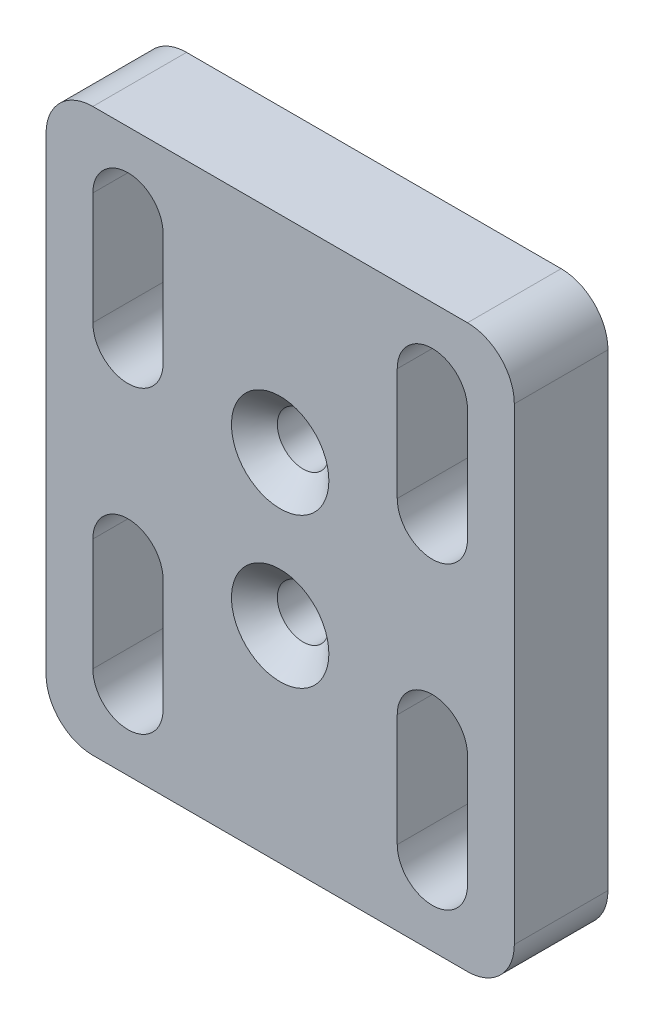
ISO-10303-21;
HEADER;
FILE_DESCRIPTION(('STEP AP214'),'2;1');
FILE_NAME('part.step','',(''),(''),'','','');
FILE_SCHEMA(('AUTOMOTIVE_DESIGN { 1 0 10303 214 1 1 1 1 }'));
ENDSEC;
DATA;
#1=APPLICATION_CONTEXT('core data for automotive mechanical design processes');
#2=APPLICATION_PROTOCOL_DEFINITION('international standard','automotive_design',2000,#1);
#3=PRODUCT_CONTEXT('',#1,'mechanical');
#4=PRODUCT('Part','Part','',(#3));
#5=PRODUCT_RELATED_PRODUCT_CATEGORY('part','',(#4));
#6=PRODUCT_DEFINITION_FORMATION('','',#4);
#7=PRODUCT_DEFINITION_CONTEXT('part definition',#1,'design');
#8=PRODUCT_DEFINITION('design','',#6,#7);
#9=PRODUCT_DEFINITION_SHAPE('','',#8);
#10=(LENGTH_UNIT() NAMED_UNIT(*) SI_UNIT(.MILLI.,.METRE.));
#11=(NAMED_UNIT(*) PLANE_ANGLE_UNIT() SI_UNIT($,.RADIAN.));
#12=(NAMED_UNIT(*) SI_UNIT($,.STERADIAN.) SOLID_ANGLE_UNIT());
#13=UNCERTAINTY_MEASURE_WITH_UNIT(LENGTH_MEASURE(1.E-05),#10,'distance_accuracy_value','');
#14=(GEOMETRIC_REPRESENTATION_CONTEXT(3) GLOBAL_UNCERTAINTY_ASSIGNED_CONTEXT((#13)) GLOBAL_UNIT_ASSIGNED_CONTEXT((#10,
#11,#12)) REPRESENTATION_CONTEXT('',''));
#15=CARTESIAN_POINT('',(0.,0.,0.));
#16=DIRECTION('',(0.,0.,1.));
#17=DIRECTION('',(1.,0.,0.));
#18=AXIS2_PLACEMENT_3D('',#15,#16,#17);
#19=CARTESIAN_POINT('',(0.,0.,10.));
#20=DIRECTION('',(1.,0.,0.));
#21=DIRECTION('',(0.,0.,-1.));
#22=AXIS2_PLACEMENT_3D('',#19,#20,#21);
#23=PLANE('',#22);
#24=DIRECTION('',(0.,-1.,0.));
#25=VECTOR('',#24,1.);
#26=CARTESIAN_POINT('',(0.,0.,0.));
#27=LINE('',#26,#25);
#28=CARTESIAN_POINT('',(0.,55.,0.));
#29=VERTEX_POINT('',#28);
#30=CARTESIAN_POINT('',(0.,5.,0.));
#31=VERTEX_POINT('',#30);
#32=EDGE_CURVE('E330',#29,#31,#27,.T.);
#33=ORIENTED_EDGE('',*,*,#32,.T.);
#34=DIRECTION('',(0.,0.,-1.));
#35=VECTOR('',#34,1.);
#36=CARTESIAN_POINT('',(0.,5.,10.));
#37=LINE('',#36,#35);
#38=CARTESIAN_POINT('',(0.,5.,10.));
#39=VERTEX_POINT('',#38);
#40=EDGE_CURVE('E389',#31,#39,#37,.F.);
#41=ORIENTED_EDGE('',*,*,#40,.T.);
#42=DIRECTION('',(0.,-1.,0.));
#43=VECTOR('',#42,1.);
#44=CARTESIAN_POINT('',(0.,0.,10.));
#45=LINE('',#44,#43);
#46=CARTESIAN_POINT('',(0.,55.,10.));
#47=VERTEX_POINT('',#46);
#48=EDGE_CURVE('E337',#47,#39,#45,.T.);
#49=ORIENTED_EDGE('',*,*,#48,.F.);
#50=DIRECTION('',(0.,0.,-1.));
#51=VECTOR('',#50,1.);
#52=CARTESIAN_POINT('',(0.,55.,10.));
#53=LINE('',#52,#51);
#54=EDGE_CURVE('E386',#47,#29,#53,.T.);
#55=ORIENTED_EDGE('',*,*,#54,.T.);
#56=EDGE_LOOP('',(#33,#41,#49,#55));
#57=FACE_BOUND('',#56,.T.);
#58=ADVANCED_FACE('F37',(#57),#23,.F.);
#59=CARTESIAN_POINT('',(0.,0.,10.));
#60=DIRECTION('',(0.,1.,0.));
#61=DIRECTION('',(0.,0.,1.));
#62=AXIS2_PLACEMENT_3D('',#59,#60,#61);
#63=PLANE('',#62);
#64=DIRECTION('',(1.,0.,0.));
#65=VECTOR('',#64,1.);
#66=CARTESIAN_POINT('',(0.,0.,0.));
#67=LINE('',#66,#65);
#68=CARTESIAN_POINT('',(5.,0.,0.));
#69=VERTEX_POINT('',#68);
#70=CARTESIAN_POINT('',(45.,0.,0.));
#71=VERTEX_POINT('',#70);
#72=EDGE_CURVE('E353',#69,#71,#67,.T.);
#73=ORIENTED_EDGE('',*,*,#72,.T.);
#74=DIRECTION('',(0.,0.,-1.));
#75=VECTOR('',#74,1.);
#76=CARTESIAN_POINT('',(45.,0.,10.));
#77=LINE('',#76,#75);
#78=CARTESIAN_POINT('',(45.,0.,10.));
#79=VERTEX_POINT('',#78);
#80=EDGE_CURVE('E376',#71,#79,#77,.F.);
#81=ORIENTED_EDGE('',*,*,#80,.T.);
#82=DIRECTION('',(1.,0.,0.));
#83=VECTOR('',#82,1.);
#84=CARTESIAN_POINT('',(0.,0.,10.));
#85=LINE('',#84,#83);
#86=CARTESIAN_POINT('',(5.,0.,10.));
#87=VERTEX_POINT('',#86);
#88=EDGE_CURVE('E340',#87,#79,#85,.T.);
#89=ORIENTED_EDGE('',*,*,#88,.F.);
#90=DIRECTION('',(0.,0.,-1.));
#91=VECTOR('',#90,1.);
#92=CARTESIAN_POINT('',(5.,0.,10.));
#93=LINE('',#92,#91);
#94=EDGE_CURVE('E373',#87,#69,#93,.T.);
#95=ORIENTED_EDGE('',*,*,#94,.T.);
#96=EDGE_LOOP('',(#73,#81,#89,#95));
#97=FACE_BOUND('',#96,.T.);
#98=ADVANCED_FACE('F465',(#97),#63,.F.);
#99=CARTESIAN_POINT('',(50.,0.,10.));
#100=DIRECTION('',(-1.,0.,0.));
#101=DIRECTION('',(0.,0.,1.));
#102=AXIS2_PLACEMENT_3D('',#99,#100,#101);
#103=PLANE('',#102);
#104=DIRECTION('',(0.,1.,0.));
#105=VECTOR('',#104,1.);
#106=CARTESIAN_POINT('',(50.,0.,10.));
#107=LINE('',#106,#105);
#108=CARTESIAN_POINT('',(50.,5.,10.));
#109=VERTEX_POINT('',#108);
#110=CARTESIAN_POINT('',(50.,55.,10.));
#111=VERTEX_POINT('',#110);
#112=EDGE_CURVE('E344',#109,#111,#107,.T.);
#113=ORIENTED_EDGE('',*,*,#112,.F.);
#114=DIRECTION('',(0.,0.,-1.));
#115=VECTOR('',#114,1.);
#116=CARTESIAN_POINT('',(50.,5.,10.));
#117=LINE('',#116,#115);
#118=CARTESIAN_POINT('',(50.,5.,0.));
#119=VERTEX_POINT('',#118);
#120=EDGE_CURVE('E362',#109,#119,#117,.T.);
#121=ORIENTED_EDGE('',*,*,#120,.T.);
#122=DIRECTION('',(0.,1.,0.));
#123=VECTOR('',#122,1.);
#124=CARTESIAN_POINT('',(50.,0.,0.));
#125=LINE('',#124,#123);
#126=CARTESIAN_POINT('',(50.,55.,0.));
#127=VERTEX_POINT('',#126);
#128=EDGE_CURVE('E356',#119,#127,#125,.T.);
#129=ORIENTED_EDGE('',*,*,#128,.T.);
#130=DIRECTION('',(0.,0.,-1.));
#131=VECTOR('',#130,1.);
#132=CARTESIAN_POINT('',(50.,55.,10.));
#133=LINE('',#132,#131);
#134=EDGE_CURVE('E350',#127,#111,#133,.F.);
#135=ORIENTED_EDGE('',*,*,#134,.T.);
#136=EDGE_LOOP('',(#113,#121,#129,#135));
#137=FACE_BOUND('',#136,.T.);
#138=ADVANCED_FACE('F444',(#137),#103,.F.);
#139=CARTESIAN_POINT('',(0.,60.,10.));
#140=DIRECTION('',(0.,-1.,0.));
#141=DIRECTION('',(0.,0.,-1.));
#142=AXIS2_PLACEMENT_3D('',#139,#140,#141);
#143=PLANE('',#142);
#144=DIRECTION('',(-1.,0.,0.));
#145=VECTOR('',#144,1.);
#146=CARTESIAN_POINT('',(0.,60.,0.));
#147=LINE('',#146,#145);
#148=CARTESIAN_POINT('',(45.,60.,0.));
#149=VERTEX_POINT('',#148);
#150=CARTESIAN_POINT('',(5.,60.,0.));
#151=VERTEX_POINT('',#150);
#152=EDGE_CURVE('E341',#149,#151,#147,.T.);
#153=ORIENTED_EDGE('',*,*,#152,.T.);
#154=DIRECTION('',(0.,0.,-1.));
#155=VECTOR('',#154,1.);
#156=CARTESIAN_POINT('',(5.,60.,10.));
#157=LINE('',#156,#155);
#158=CARTESIAN_POINT('',(5.,60.,10.));
#159=VERTEX_POINT('',#158);
#160=EDGE_CURVE('E11',#151,#159,#157,.F.);
#161=ORIENTED_EDGE('',*,*,#160,.T.);
#162=DIRECTION('',(-1.,0.,0.));
#163=VECTOR('',#162,1.);
#164=CARTESIAN_POINT('',(0.,60.,10.));
#165=LINE('',#164,#163);
#166=CARTESIAN_POINT('',(45.,60.,10.));
#167=VERTEX_POINT('',#166);
#168=EDGE_CURVE('E347',#167,#159,#165,.T.);
#169=ORIENTED_EDGE('',*,*,#168,.F.);
#170=DIRECTION('',(0.,0.,-1.));
#171=VECTOR('',#170,1.);
#172=CARTESIAN_POINT('',(45.,60.,10.));
#173=LINE('',#172,#171);
#174=EDGE_CURVE('E46',#167,#149,#173,.T.);
#175=ORIENTED_EDGE('',*,*,#174,.T.);
#176=EDGE_LOOP('',(#153,#161,#169,#175));
#177=FACE_BOUND('',#176,.T.);
#178=ADVANCED_FACE('F416',(#177),#143,.F.);
#179=CARTESIAN_POINT('',(0.,0.,10.));
#180=DIRECTION('',(0.,0.,-1.));
#181=DIRECTION('',(-1.,0.,0.));
#182=AXIS2_PLACEMENT_3D('',#179,#180,#181);
#183=PLANE('',#182);
#184=CARTESIAN_POINT('',(25.,38.,10.));
#185=DIRECTION('',(0.,0.,1.));
#186=DIRECTION('',(1.,0.,0.));
#187=AXIS2_PLACEMENT_3D('',#184,#185,#186);
#188=CIRCLE('',#187,5.2);
#189=CARTESIAN_POINT('',(30.2,38.,10.));
#190=VERTEX_POINT('',#189);
#191=EDGE_CURVE('E407',#190,#190,#188,.T.);
#192=ORIENTED_EDGE('',*,*,#191,.F.);
#193=EDGE_LOOP('',(#192));
#194=FACE_BOUND('',#193,.T.);
#195=CARTESIAN_POINT('',(25.,22.,10.));
#196=DIRECTION('',(0.,0.,1.));
#197=DIRECTION('',(1.,0.,0.));
#198=AXIS2_PLACEMENT_3D('',#195,#196,#197);
#199=CIRCLE('',#198,5.2);
#200=CARTESIAN_POINT('',(30.2,22.,10.));
#201=VERTEX_POINT('',#200);
#202=EDGE_CURVE('E396',#201,#201,#199,.T.);
#203=ORIENTED_EDGE('',*,*,#202,.F.);
#204=EDGE_LOOP('',(#203));
#205=FACE_BOUND('',#204,.T.);
#206=DIRECTION('',(0.,1.,0.));
#207=VECTOR('',#206,1.);
#208=CARTESIAN_POINT('',(12.5,40.,10.));
#209=LINE('',#208,#207);
#210=CARTESIAN_POINT('',(12.5,40.,10.));
#211=VERTEX_POINT('',#210);
#212=CARTESIAN_POINT('',(12.5,52.,10.));
#213=VERTEX_POINT('',#212);
#214=EDGE_CURVE('E258',#211,#213,#209,.T.);
#215=ORIENTED_EDGE('',*,*,#214,.F.);
#216=CARTESIAN_POINT('',(8.75000000000002,40.,10.));
#217=DIRECTION('',(0.,0.,1.));
#218=DIRECTION('',(-1.,0.,0.));
#219=AXIS2_PLACEMENT_3D('',#216,#217,#218);
#220=CIRCLE('',#219,3.74999999999998);
#221=CARTESIAN_POINT('',(5.00000000000001,40.,10.));
#222=VERTEX_POINT('',#221);
#223=EDGE_CURVE('E54',#222,#211,#220,.T.);
#224=ORIENTED_EDGE('',*,*,#223,.F.);
#225=DIRECTION('',(0.,-1.,0.));
#226=VECTOR('',#225,1.);
#227=CARTESIAN_POINT('',(5.00000000000001,40.,10.));
#228=LINE('',#227,#226);
#229=CARTESIAN_POINT('',(5.00000000000001,52.,10.));
#230=VERTEX_POINT('',#229);
#231=EDGE_CURVE('E247',#230,#222,#228,.T.);
#232=ORIENTED_EDGE('',*,*,#231,.F.);
#233=CARTESIAN_POINT('',(8.75000000000002,52.,10.));
#234=DIRECTION('',(0.,0.,1.));
#235=DIRECTION('',(-1.,0.,0.));
#236=AXIS2_PLACEMENT_3D('',#233,#234,#235);
#237=CIRCLE('',#236,3.75000000000001);
#238=EDGE_CURVE('E262',#213,#230,#237,.T.);
#239=ORIENTED_EDGE('',*,*,#238,.F.);
#240=EDGE_LOOP('',(#215,#224,#232,#239));
#241=FACE_BOUND('',#240,.T.);
#242=DIRECTION('',(0.,-1.,0.));
#243=VECTOR('',#242,1.);
#244=CARTESIAN_POINT('',(37.5,20.,10.));
#245=LINE('',#244,#243);
#246=CARTESIAN_POINT('',(37.5,20.,10.));
#247=VERTEX_POINT('',#246);
#248=CARTESIAN_POINT('',(37.5,8.00000000000001,10.));
#249=VERTEX_POINT('',#248);
#250=EDGE_CURVE('E232',#247,#249,#245,.T.);
#251=ORIENTED_EDGE('',*,*,#250,.F.);
#252=CARTESIAN_POINT('',(41.25,20.,10.));
#253=DIRECTION('',(0.,0.,1.));
#254=DIRECTION('',(-1.,0.,0.));
#255=AXIS2_PLACEMENT_3D('',#252,#253,#254);
#256=CIRCLE('',#255,3.75);
#257=CARTESIAN_POINT('',(45.,20.,10.));
#258=VERTEX_POINT('',#257);
#259=EDGE_CURVE('E62',#258,#247,#256,.T.);
#260=ORIENTED_EDGE('',*,*,#259,.F.);
#261=DIRECTION('',(0.,1.,0.));
#262=VECTOR('',#261,1.);
#263=CARTESIAN_POINT('',(45.,20.,10.));
#264=LINE('',#263,#262);
#265=CARTESIAN_POINT('',(45.,8.00000000000001,10.));
#266=VERTEX_POINT('',#265);
#267=EDGE_CURVE('E220',#266,#258,#264,.T.);
#268=ORIENTED_EDGE('',*,*,#267,.F.);
#269=CARTESIAN_POINT('',(41.25,8.,10.));
#270=DIRECTION('',(0.,0.,1.));
#271=DIRECTION('',(-1.,0.,0.));
#272=AXIS2_PLACEMENT_3D('',#269,#270,#271);
#273=CIRCLE('',#272,3.75);
#274=EDGE_CURVE('E223',#249,#266,#273,.T.);
#275=ORIENTED_EDGE('',*,*,#274,.F.);
#276=EDGE_LOOP('',(#251,#260,#268,#275));
#277=FACE_BOUND('',#276,.T.);
#278=DIRECTION('',(0.,1.,0.));
#279=VECTOR('',#278,1.);
#280=CARTESIAN_POINT('',(45.,40.,10.));
#281=LINE('',#280,#279);
#282=CARTESIAN_POINT('',(45.,40.,10.));
#283=VERTEX_POINT('',#282);
#284=CARTESIAN_POINT('',(45.,52.,10.));
#285=VERTEX_POINT('',#284);
#286=EDGE_CURVE('E288',#283,#285,#281,.T.);
#287=ORIENTED_EDGE('',*,*,#286,.F.);
#288=CARTESIAN_POINT('',(41.25,40.,10.));
#289=DIRECTION('',(0.,0.,1.));
#290=DIRECTION('',(1.,0.,0.));
#291=AXIS2_PLACEMENT_3D('',#288,#289,#290);
#292=CIRCLE('',#291,3.75);
#293=CARTESIAN_POINT('',(37.5,40.,10.));
#294=VERTEX_POINT('',#293);
#295=EDGE_CURVE('E239',#294,#283,#292,.T.);
#296=ORIENTED_EDGE('',*,*,#295,.F.);
#297=DIRECTION('',(0.,-1.,0.));
#298=VECTOR('',#297,1.);
#299=CARTESIAN_POINT('',(37.5,40.,10.));
#300=LINE('',#299,#298);
#301=CARTESIAN_POINT('',(37.5,52.,10.));
#302=VERTEX_POINT('',#301);
#303=EDGE_CURVE('E277',#302,#294,#300,.T.);
#304=ORIENTED_EDGE('',*,*,#303,.F.);
#305=CARTESIAN_POINT('',(41.25,52.,10.));
#306=DIRECTION('',(0.,0.,1.));
#307=DIRECTION('',(1.,0.,0.));
#308=AXIS2_PLACEMENT_3D('',#305,#306,#307);
#309=CIRCLE('',#308,3.75);
#310=EDGE_CURVE('E291',#285,#302,#309,.T.);
#311=ORIENTED_EDGE('',*,*,#310,.F.);
#312=EDGE_LOOP('',(#287,#296,#304,#311));
#313=FACE_BOUND('',#312,.T.);
#314=DIRECTION('',(0.,-1.,0.));
#315=VECTOR('',#314,1.);
#316=CARTESIAN_POINT('',(5.00000000000001,20.,10.));
#317=LINE('',#316,#315);
#318=CARTESIAN_POINT('',(5.00000000000001,20.,10.));
#319=VERTEX_POINT('',#318);
#320=CARTESIAN_POINT('',(5.00000000000001,7.99999999999999,10.));
#321=VERTEX_POINT('',#320);
#322=EDGE_CURVE('E320',#319,#321,#317,.T.);
#323=ORIENTED_EDGE('',*,*,#322,.F.);
#324=CARTESIAN_POINT('',(8.75000000000002,20.,10.));
#325=DIRECTION('',(0.,0.,1.));
#326=DIRECTION('',(1.,0.,0.));
#327=AXIS2_PLACEMENT_3D('',#324,#325,#326);
#328=CIRCLE('',#327,3.74999999999998);
#329=CARTESIAN_POINT('',(12.5,20.,10.));
#330=VERTEX_POINT('',#329);
#331=EDGE_CURVE('E298',#330,#319,#328,.T.);
#332=ORIENTED_EDGE('',*,*,#331,.F.);
#333=DIRECTION('',(0.,1.,0.));
#334=VECTOR('',#333,1.);
#335=CARTESIAN_POINT('',(12.5,20.,10.));
#336=LINE('',#335,#334);
#337=CARTESIAN_POINT('',(12.5,8.,10.));
#338=VERTEX_POINT('',#337);
#339=EDGE_CURVE('E309',#338,#330,#336,.T.);
#340=ORIENTED_EDGE('',*,*,#339,.F.);
#341=CARTESIAN_POINT('',(8.75000000000002,8.,10.));
#342=DIRECTION('',(0.,0.,1.));
#343=DIRECTION('',(1.,0.,0.));
#344=AXIS2_PLACEMENT_3D('',#341,#342,#343);
#345=CIRCLE('',#344,3.75000000000001);
#346=EDGE_CURVE('E323',#321,#338,#345,.T.);
#347=ORIENTED_EDGE('',*,*,#346,.F.);
#348=EDGE_LOOP('',(#323,#332,#340,#347));
#349=FACE_BOUND('',#348,.T.);
#350=ORIENTED_EDGE('',*,*,#88,.T.);
#351=CARTESIAN_POINT('',(45.,5.,10.));
#352=DIRECTION('',(0.,0.,-1.));
#353=DIRECTION('',(-1.,0.,0.));
#354=AXIS2_PLACEMENT_3D('',#351,#352,#353);
#355=CIRCLE('',#354,5.);
#356=EDGE_CURVE('E384',#79,#109,#355,.F.);
#357=ORIENTED_EDGE('',*,*,#356,.T.);
#358=ORIENTED_EDGE('',*,*,#112,.T.);
#359=CARTESIAN_POINT('',(45.,55.,10.));
#360=DIRECTION('',(0.,0.,-1.));
#361=DIRECTION('',(-1.,0.,0.));
#362=AXIS2_PLACEMENT_3D('',#359,#360,#361);
#363=CIRCLE('',#362,5.);
#364=EDGE_CURVE('E378',#111,#167,#363,.F.);
#365=ORIENTED_EDGE('',*,*,#364,.T.);
#366=ORIENTED_EDGE('',*,*,#168,.T.);
#367=CARTESIAN_POINT('',(5.,55.,10.));
#368=DIRECTION('',(0.,0.,-1.));
#369=DIRECTION('',(-1.,0.,0.));
#370=AXIS2_PLACEMENT_3D('',#367,#368,#369);
#371=CIRCLE('',#370,5.);
#372=EDGE_CURVE('E380',#159,#47,#371,.F.);
#373=ORIENTED_EDGE('',*,*,#372,.T.);
#374=ORIENTED_EDGE('',*,*,#48,.T.);
#375=CARTESIAN_POINT('',(5.,5.,10.));
#376=DIRECTION('',(0.,0.,-1.));
#377=DIRECTION('',(-1.,0.,0.));
#378=AXIS2_PLACEMENT_3D('',#375,#376,#377);
#379=CIRCLE('',#378,5.);
#380=EDGE_CURVE('E382',#39,#87,#379,.F.);
#381=ORIENTED_EDGE('',*,*,#380,.T.);
#382=EDGE_LOOP('',(#350,#357,#358,#365,#366,#373,#374,#381));
#383=FACE_BOUND('',#382,.T.);
#384=ADVANCED_FACE('F413',(#194,#205,#241,#277,#313,#349,#383),#183,.F.);
#385=CARTESIAN_POINT('',(0.,0.,0.));
#386=DIRECTION('',(0.,0.,-1.));
#387=DIRECTION('',(-1.,0.,0.));
#388=AXIS2_PLACEMENT_3D('',#385,#386,#387);
#389=PLANE('',#388);
#390=CARTESIAN_POINT('',(25.,38.,0.));
#391=DIRECTION('',(0.,0.,-1.));
#392=DIRECTION('',(-1.,0.,0.));
#393=AXIS2_PLACEMENT_3D('',#390,#391,#392);
#394=CIRCLE('',#393,2.74999999999999);
#395=CARTESIAN_POINT('',(22.25,38.,0.));
#396=VERTEX_POINT('',#395);
#397=EDGE_CURVE('E41',#396,#396,#394,.T.);
#398=ORIENTED_EDGE('',*,*,#397,.F.);
#399=EDGE_LOOP('',(#398));
#400=FACE_BOUND('',#399,.T.);
#401=CARTESIAN_POINT('',(25.,22.,0.));
#402=DIRECTION('',(0.,0.,-1.));
#403=DIRECTION('',(-1.,0.,0.));
#404=AXIS2_PLACEMENT_3D('',#401,#402,#403);
#405=CIRCLE('',#404,2.74999999999999);
#406=CARTESIAN_POINT('',(22.25,22.,0.));
#407=VERTEX_POINT('',#406);
#408=EDGE_CURVE('E259',#407,#407,#405,.T.);
#409=ORIENTED_EDGE('',*,*,#408,.F.);
#410=EDGE_LOOP('',(#409));
#411=FACE_BOUND('',#410,.T.);
#412=CARTESIAN_POINT('',(8.75000000000002,40.,0.));
#413=DIRECTION('',(0.,0.,1.));
#414=DIRECTION('',(-1.,0.,0.));
#415=AXIS2_PLACEMENT_3D('',#412,#413,#414);
#416=CIRCLE('',#415,3.74999999999998);
#417=CARTESIAN_POINT('',(5.00000000000001,40.,0.));
#418=VERTEX_POINT('',#417);
#419=CARTESIAN_POINT('',(12.5,40.,0.));
#420=VERTEX_POINT('',#419);
#421=EDGE_CURVE('E243',#418,#420,#416,.T.);
#422=ORIENTED_EDGE('',*,*,#421,.T.);
#423=DIRECTION('',(0.,1.,0.));
#424=VECTOR('',#423,1.);
#425=CARTESIAN_POINT('',(12.5,40.,0.));
#426=LINE('',#425,#424);
#427=CARTESIAN_POINT('',(12.5,52.,0.));
#428=VERTEX_POINT('',#427);
#429=EDGE_CURVE('E246',#420,#428,#426,.T.);
#430=ORIENTED_EDGE('',*,*,#429,.T.);
#431=CARTESIAN_POINT('',(8.75000000000002,52.,0.));
#432=DIRECTION('',(0.,0.,1.));
#433=DIRECTION('',(-1.,0.,0.));
#434=AXIS2_PLACEMENT_3D('',#431,#432,#433);
#435=CIRCLE('',#434,3.75000000000001);
#436=CARTESIAN_POINT('',(5.00000000000001,52.,0.));
#437=VERTEX_POINT('',#436);
#438=EDGE_CURVE('E250',#428,#437,#435,.T.);
#439=ORIENTED_EDGE('',*,*,#438,.T.);
#440=DIRECTION('',(0.,-1.,0.));
#441=VECTOR('',#440,1.);
#442=CARTESIAN_POINT('',(5.00000000000001,40.,0.));
#443=LINE('',#442,#441);
#444=EDGE_CURVE('E253',#437,#418,#443,.T.);
#445=ORIENTED_EDGE('',*,*,#444,.T.);
#446=EDGE_LOOP('',(#422,#430,#439,#445));
#447=FACE_BOUND('',#446,.T.);
#448=CARTESIAN_POINT('',(41.25,20.,0.));
#449=DIRECTION('',(0.,0.,1.));
#450=DIRECTION('',(-1.,0.,0.));
#451=AXIS2_PLACEMENT_3D('',#448,#449,#450);
#452=CIRCLE('',#451,3.75);
#453=CARTESIAN_POINT('',(45.,20.,0.));
#454=VERTEX_POINT('',#453);
#455=CARTESIAN_POINT('',(37.5,20.,0.));
#456=VERTEX_POINT('',#455);
#457=EDGE_CURVE('E201',#454,#456,#452,.T.);
#458=ORIENTED_EDGE('',*,*,#457,.T.);
#459=DIRECTION('',(0.,-1.,0.));
#460=VECTOR('',#459,1.);
#461=CARTESIAN_POINT('',(37.5,20.,0.));
#462=LINE('',#461,#460);
#463=CARTESIAN_POINT('',(37.5,8.00000000000001,0.));
#464=VERTEX_POINT('',#463);
#465=EDGE_CURVE('E211',#456,#464,#462,.T.);
#466=ORIENTED_EDGE('',*,*,#465,.T.);
#467=CARTESIAN_POINT('',(41.25,8.,0.));
#468=DIRECTION('',(0.,0.,1.));
#469=DIRECTION('',(-1.,0.,0.));
#470=AXIS2_PLACEMENT_3D('',#467,#468,#469);
#471=CIRCLE('',#470,3.75);
#472=CARTESIAN_POINT('',(45.,8.00000000000001,0.));
#473=VERTEX_POINT('',#472);
#474=EDGE_CURVE('E215',#464,#473,#471,.T.);
#475=ORIENTED_EDGE('',*,*,#474,.T.);
#476=DIRECTION('',(0.,1.,0.));
#477=VECTOR('',#476,1.);
#478=CARTESIAN_POINT('',(45.,20.,0.));
#479=LINE('',#478,#477);
#480=EDGE_CURVE('E207',#473,#454,#479,.T.);
#481=ORIENTED_EDGE('',*,*,#480,.T.);
#482=EDGE_LOOP('',(#458,#466,#475,#481));
#483=FACE_BOUND('',#482,.T.);
#484=CARTESIAN_POINT('',(41.25,40.,0.));
#485=DIRECTION('',(0.,0.,1.));
#486=DIRECTION('',(1.,0.,0.));
#487=AXIS2_PLACEMENT_3D('',#484,#485,#486);
#488=CIRCLE('',#487,3.75);
#489=CARTESIAN_POINT('',(37.5,40.,0.));
#490=VERTEX_POINT('',#489);
#491=CARTESIAN_POINT('',(45.,40.,0.));
#492=VERTEX_POINT('',#491);
#493=EDGE_CURVE('E273',#490,#492,#488,.T.);
#494=ORIENTED_EDGE('',*,*,#493,.T.);
#495=DIRECTION('',(0.,1.,0.));
#496=VECTOR('',#495,1.);
#497=CARTESIAN_POINT('',(45.,40.,0.));
#498=LINE('',#497,#496);
#499=CARTESIAN_POINT('',(45.,52.,0.));
#500=VERTEX_POINT('',#499);
#501=EDGE_CURVE('E276',#492,#500,#498,.T.);
#502=ORIENTED_EDGE('',*,*,#501,.T.);
#503=CARTESIAN_POINT('',(41.25,52.,0.));
#504=DIRECTION('',(0.,0.,1.));
#505=DIRECTION('',(1.,0.,0.));
#506=AXIS2_PLACEMENT_3D('',#503,#504,#505);
#507=CIRCLE('',#506,3.75);
#508=CARTESIAN_POINT('',(37.5,52.,0.));
#509=VERTEX_POINT('',#508);
#510=EDGE_CURVE('E280',#500,#509,#507,.T.);
#511=ORIENTED_EDGE('',*,*,#510,.T.);
#512=DIRECTION('',(0.,-1.,0.));
#513=VECTOR('',#512,1.);
#514=CARTESIAN_POINT('',(37.5,40.,0.));
#515=LINE('',#514,#513);
#516=EDGE_CURVE('E283',#509,#490,#515,.T.);
#517=ORIENTED_EDGE('',*,*,#516,.T.);
#518=EDGE_LOOP('',(#494,#502,#511,#517));
#519=FACE_BOUND('',#518,.T.);
#520=CARTESIAN_POINT('',(8.75000000000002,20.,0.));
#521=DIRECTION('',(0.,0.,1.));
#522=DIRECTION('',(1.,0.,0.));
#523=AXIS2_PLACEMENT_3D('',#520,#521,#522);
#524=CIRCLE('',#523,3.74999999999998);
#525=CARTESIAN_POINT('',(12.5,20.,0.));
#526=VERTEX_POINT('',#525);
#527=CARTESIAN_POINT('',(5.00000000000001,20.,0.));
#528=VERTEX_POINT('',#527);
#529=EDGE_CURVE('E305',#526,#528,#524,.T.);
#530=ORIENTED_EDGE('',*,*,#529,.T.);
#531=DIRECTION('',(0.,-1.,0.));
#532=VECTOR('',#531,1.);
#533=CARTESIAN_POINT('',(5.00000000000001,20.,0.));
#534=LINE('',#533,#532);
#535=CARTESIAN_POINT('',(5.00000000000001,7.99999999999999,0.));
#536=VERTEX_POINT('',#535);
#537=EDGE_CURVE('E308',#528,#536,#534,.T.);
#538=ORIENTED_EDGE('',*,*,#537,.T.);
#539=CARTESIAN_POINT('',(8.75000000000002,8.,0.));
#540=DIRECTION('',(0.,0.,1.));
#541=DIRECTION('',(1.,0.,0.));
#542=AXIS2_PLACEMENT_3D('',#539,#540,#541);
#543=CIRCLE('',#542,3.75000000000001);
#544=CARTESIAN_POINT('',(12.5,8.,0.));
#545=VERTEX_POINT('',#544);
#546=EDGE_CURVE('E312',#536,#545,#543,.T.);
#547=ORIENTED_EDGE('',*,*,#546,.T.);
#548=DIRECTION('',(0.,1.,0.));
#549=VECTOR('',#548,1.);
#550=CARTESIAN_POINT('',(12.5,20.,0.));
#551=LINE('',#550,#549);
#552=EDGE_CURVE('E315',#545,#526,#551,.T.);
#553=ORIENTED_EDGE('',*,*,#552,.T.);
#554=EDGE_LOOP('',(#530,#538,#547,#553));
#555=FACE_BOUND('',#554,.T.);
#556=ORIENTED_EDGE('',*,*,#128,.F.);
#557=CARTESIAN_POINT('',(45.,5.,0.));
#558=DIRECTION('',(0.,0.,-1.));
#559=DIRECTION('',(-1.,0.,0.));
#560=AXIS2_PLACEMENT_3D('',#557,#558,#559);
#561=CIRCLE('',#560,5.);
#562=EDGE_CURVE('E371',#119,#71,#561,.T.);
#563=ORIENTED_EDGE('',*,*,#562,.T.);
#564=ORIENTED_EDGE('',*,*,#72,.F.);
#565=CARTESIAN_POINT('',(5.,5.,0.));
#566=DIRECTION('',(0.,0.,-1.));
#567=DIRECTION('',(-1.,0.,0.));
#568=AXIS2_PLACEMENT_3D('',#565,#566,#567);
#569=CIRCLE('',#568,5.);
#570=EDGE_CURVE('E369',#69,#31,#569,.T.);
#571=ORIENTED_EDGE('',*,*,#570,.T.);
#572=ORIENTED_EDGE('',*,*,#32,.F.);
#573=CARTESIAN_POINT('',(5.,55.,0.));
#574=DIRECTION('',(0.,0.,-1.));
#575=DIRECTION('',(-1.,0.,0.));
#576=AXIS2_PLACEMENT_3D('',#573,#574,#575);
#577=CIRCLE('',#576,5.);
#578=EDGE_CURVE('E367',#29,#151,#577,.T.);
#579=ORIENTED_EDGE('',*,*,#578,.T.);
#580=ORIENTED_EDGE('',*,*,#152,.F.);
#581=CARTESIAN_POINT('',(45.,55.,0.));
#582=DIRECTION('',(0.,0.,-1.));
#583=DIRECTION('',(-1.,0.,0.));
#584=AXIS2_PLACEMENT_3D('',#581,#582,#583);
#585=CIRCLE('',#584,5.);
#586=EDGE_CURVE('E365',#149,#127,#585,.T.);
#587=ORIENTED_EDGE('',*,*,#586,.T.);
#588=EDGE_LOOP('',(#556,#563,#564,#571,#572,#579,#580,#587));
#589=FACE_BOUND('',#588,.T.);
#590=ADVANCED_FACE('F217',(#400,#411,#447,#483,#519,#555,#589),#389,.T.);
#591=CARTESIAN_POINT('',(45.,5.,10.));
#592=DIRECTION('',(0.,0.,-1.));
#593=DIRECTION('',(-1.,0.,0.));
#594=AXIS2_PLACEMENT_3D('',#591,#592,#593);
#595=CYLINDRICAL_SURFACE('',#594,5.);
#596=ORIENTED_EDGE('',*,*,#356,.F.);
#597=ORIENTED_EDGE('',*,*,#80,.F.);
#598=ORIENTED_EDGE('',*,*,#562,.F.);
#599=ORIENTED_EDGE('',*,*,#120,.F.);
#600=EDGE_LOOP('',(#596,#597,#598,#599));
#601=FACE_BOUND('',#600,.T.);
#602=ADVANCED_FACE('F441',(#601),#595,.T.);
#603=CARTESIAN_POINT('',(5.,5.,10.));
#604=DIRECTION('',(0.,0.,-1.));
#605=DIRECTION('',(-1.,0.,0.));
#606=AXIS2_PLACEMENT_3D('',#603,#604,#605);
#607=CYLINDRICAL_SURFACE('',#606,5.);
#608=ORIENTED_EDGE('',*,*,#380,.F.);
#609=ORIENTED_EDGE('',*,*,#40,.F.);
#610=ORIENTED_EDGE('',*,*,#570,.F.);
#611=ORIENTED_EDGE('',*,*,#94,.F.);
#612=EDGE_LOOP('',(#608,#609,#610,#611));
#613=FACE_BOUND('',#612,.T.);
#614=ADVANCED_FACE('F464',(#613),#607,.T.);
#615=CARTESIAN_POINT('',(5.,55.,10.));
#616=DIRECTION('',(0.,0.,-1.));
#617=DIRECTION('',(-1.,0.,0.));
#618=AXIS2_PLACEMENT_3D('',#615,#616,#617);
#619=CYLINDRICAL_SURFACE('',#618,5.);
#620=ORIENTED_EDGE('',*,*,#372,.F.);
#621=ORIENTED_EDGE('',*,*,#160,.F.);
#622=ORIENTED_EDGE('',*,*,#578,.F.);
#623=ORIENTED_EDGE('',*,*,#54,.F.);
#624=EDGE_LOOP('',(#620,#621,#622,#623));
#625=FACE_BOUND('',#624,.T.);
#626=ADVANCED_FACE('F459',(#625),#619,.T.);
#627=CARTESIAN_POINT('',(45.,55.,10.));
#628=DIRECTION('',(0.,0.,-1.));
#629=DIRECTION('',(-1.,0.,0.));
#630=AXIS2_PLACEMENT_3D('',#627,#628,#629);
#631=CYLINDRICAL_SURFACE('',#630,5.);
#632=ORIENTED_EDGE('',*,*,#364,.F.);
#633=ORIENTED_EDGE('',*,*,#134,.F.);
#634=ORIENTED_EDGE('',*,*,#586,.F.);
#635=ORIENTED_EDGE('',*,*,#174,.F.);
#636=EDGE_LOOP('',(#632,#633,#634,#635));
#637=FACE_BOUND('',#636,.T.);
#638=ADVANCED_FACE('F39',(#637),#631,.T.);
#639=CARTESIAN_POINT('',(8.75000000000002,20.,0.));
#640=DIRECTION('',(0.,0.,1.));
#641=DIRECTION('',(1.,0.,0.));
#642=AXIS2_PLACEMENT_3D('',#639,#640,#641);
#643=CYLINDRICAL_SURFACE('',#642,3.74999999999998);
#644=ORIENTED_EDGE('',*,*,#331,.T.);
#645=DIRECTION('',(0.,0.,1.));
#646=VECTOR('',#645,1.);
#647=CARTESIAN_POINT('',(5.00000000000001,20.,0.));
#648=LINE('',#647,#646);
#649=EDGE_CURVE('E318',#528,#319,#648,.T.);
#650=ORIENTED_EDGE('',*,*,#649,.F.);
#651=ORIENTED_EDGE('',*,*,#529,.F.);
#652=DIRECTION('',(0.,0.,1.));
#653=VECTOR('',#652,1.);
#654=CARTESIAN_POINT('',(12.5,20.,0.));
#655=LINE('',#654,#653);
#656=EDGE_CURVE('E328',#526,#330,#655,.T.);
#657=ORIENTED_EDGE('',*,*,#656,.T.);
#658=EDGE_LOOP('',(#644,#650,#651,#657));
#659=FACE_BOUND('',#658,.T.);
#660=ADVANCED_FACE('F483',(#659),#643,.F.);
#661=CARTESIAN_POINT('',(12.5,20.,0.));
#662=DIRECTION('',(1.,0.,0.));
#663=DIRECTION('',(0.,1.,0.));
#664=AXIS2_PLACEMENT_3D('',#661,#662,#663);
#665=PLANE('',#664);
#666=ORIENTED_EDGE('',*,*,#339,.T.);
#667=ORIENTED_EDGE('',*,*,#656,.F.);
#668=ORIENTED_EDGE('',*,*,#552,.F.);
#669=DIRECTION('',(0.,0.,1.));
#670=VECTOR('',#669,1.);
#671=CARTESIAN_POINT('',(12.5,8.,0.));
#672=LINE('',#671,#670);
#673=EDGE_CURVE('E331',#545,#338,#672,.T.);
#674=ORIENTED_EDGE('',*,*,#673,.T.);
#675=EDGE_LOOP('',(#666,#667,#668,#674));
#676=FACE_BOUND('',#675,.T.);
#677=ADVANCED_FACE('F487',(#676),#665,.F.);
#678=CARTESIAN_POINT('',(8.75000000000002,8.,0.));
#679=DIRECTION('',(0.,0.,1.));
#680=DIRECTION('',(1.,0.,0.));
#681=AXIS2_PLACEMENT_3D('',#678,#679,#680);
#682=CYLINDRICAL_SURFACE('',#681,3.75000000000001);
#683=ORIENTED_EDGE('',*,*,#346,.T.);
#684=ORIENTED_EDGE('',*,*,#673,.F.);
#685=ORIENTED_EDGE('',*,*,#546,.F.);
#686=DIRECTION('',(0.,0.,1.));
#687=VECTOR('',#686,1.);
#688=CARTESIAN_POINT('',(5.00000000000001,7.99999999999999,0.));
#689=LINE('',#688,#687);
#690=EDGE_CURVE('E333',#536,#321,#689,.T.);
#691=ORIENTED_EDGE('',*,*,#690,.T.);
#692=EDGE_LOOP('',(#683,#684,#685,#691));
#693=FACE_BOUND('',#692,.T.);
#694=ADVANCED_FACE('F493',(#693),#682,.F.);
#695=CARTESIAN_POINT('',(5.00000000000001,20.,0.));
#696=DIRECTION('',(-1.,0.,0.));
#697=DIRECTION('',(0.,-1.,0.));
#698=AXIS2_PLACEMENT_3D('',#695,#696,#697);
#699=PLANE('',#698);
#700=ORIENTED_EDGE('',*,*,#322,.T.);
#701=ORIENTED_EDGE('',*,*,#690,.F.);
#702=ORIENTED_EDGE('',*,*,#537,.F.);
#703=ORIENTED_EDGE('',*,*,#649,.T.);
#704=EDGE_LOOP('',(#700,#701,#702,#703));
#705=FACE_BOUND('',#704,.T.);
#706=ADVANCED_FACE('F497',(#705),#699,.F.);
#707=CARTESIAN_POINT('',(41.25,40.,0.));
#708=DIRECTION('',(0.,0.,1.));
#709=DIRECTION('',(1.,0.,0.));
#710=AXIS2_PLACEMENT_3D('',#707,#708,#709);
#711=CYLINDRICAL_SURFACE('',#710,3.75);
#712=ORIENTED_EDGE('',*,*,#295,.T.);
#713=DIRECTION('',(0.,0.,1.));
#714=VECTOR('',#713,1.);
#715=CARTESIAN_POINT('',(45.,40.,0.));
#716=LINE('',#715,#714);
#717=EDGE_CURVE('E286',#492,#283,#716,.T.);
#718=ORIENTED_EDGE('',*,*,#717,.F.);
#719=ORIENTED_EDGE('',*,*,#493,.F.);
#720=DIRECTION('',(0.,0.,1.));
#721=VECTOR('',#720,1.);
#722=CARTESIAN_POINT('',(37.5,40.,0.));
#723=LINE('',#722,#721);
#724=EDGE_CURVE('E296',#490,#294,#723,.T.);
#725=ORIENTED_EDGE('',*,*,#724,.T.);
#726=EDGE_LOOP('',(#712,#718,#719,#725));
#727=FACE_BOUND('',#726,.T.);
#728=ADVANCED_FACE('F560',(#727),#711,.F.);
#729=CARTESIAN_POINT('',(37.5,40.,0.));
#730=DIRECTION('',(-1.,0.,0.));
#731=DIRECTION('',(0.,0.,1.));
#732=AXIS2_PLACEMENT_3D('',#729,#730,#731);
#733=PLANE('',#732);
#734=ORIENTED_EDGE('',*,*,#303,.T.);
#735=ORIENTED_EDGE('',*,*,#724,.F.);
#736=ORIENTED_EDGE('',*,*,#516,.F.);
#737=DIRECTION('',(0.,0.,1.));
#738=VECTOR('',#737,1.);
#739=CARTESIAN_POINT('',(37.5,52.,0.));
#740=LINE('',#739,#738);
#741=EDGE_CURVE('E299',#509,#302,#740,.T.);
#742=ORIENTED_EDGE('',*,*,#741,.T.);
#743=EDGE_LOOP('',(#734,#735,#736,#742));
#744=FACE_BOUND('',#743,.T.);
#745=ADVANCED_FACE('F569',(#744),#733,.F.);
#746=CARTESIAN_POINT('',(41.25,52.,0.));
#747=DIRECTION('',(0.,0.,1.));
#748=DIRECTION('',(1.,0.,0.));
#749=AXIS2_PLACEMENT_3D('',#746,#747,#748);
#750=CYLINDRICAL_SURFACE('',#749,3.75);
#751=ORIENTED_EDGE('',*,*,#310,.T.);
#752=ORIENTED_EDGE('',*,*,#741,.F.);
#753=ORIENTED_EDGE('',*,*,#510,.F.);
#754=DIRECTION('',(0.,0.,1.));
#755=VECTOR('',#754,1.);
#756=CARTESIAN_POINT('',(45.,52.,0.));
#757=LINE('',#756,#755);
#758=EDGE_CURVE('E301',#500,#285,#757,.T.);
#759=ORIENTED_EDGE('',*,*,#758,.T.);
#760=EDGE_LOOP('',(#751,#752,#753,#759));
#761=FACE_BOUND('',#760,.T.);
#762=ADVANCED_FACE('F579',(#761),#750,.F.);
#763=CARTESIAN_POINT('',(45.,40.,0.));
#764=DIRECTION('',(1.,0.,0.));
#765=DIRECTION('',(0.,0.,-1.));
#766=AXIS2_PLACEMENT_3D('',#763,#764,#765);
#767=PLANE('',#766);
#768=ORIENTED_EDGE('',*,*,#286,.T.);
#769=ORIENTED_EDGE('',*,*,#758,.F.);
#770=ORIENTED_EDGE('',*,*,#501,.F.);
#771=ORIENTED_EDGE('',*,*,#717,.T.);
#772=EDGE_LOOP('',(#768,#769,#770,#771));
#773=FACE_BOUND('',#772,.T.);
#774=ADVANCED_FACE('F589',(#773),#767,.F.);
#775=CARTESIAN_POINT('',(41.25,20.,0.));
#776=DIRECTION('',(0.,0.,1.));
#777=DIRECTION('',(1.,0.,0.));
#778=AXIS2_PLACEMENT_3D('',#775,#776,#777);
#779=CYLINDRICAL_SURFACE('',#778,3.75);
#780=ORIENTED_EDGE('',*,*,#259,.T.);
#781=DIRECTION('',(0.,0.,1.));
#782=VECTOR('',#781,1.);
#783=CARTESIAN_POINT('',(37.5,20.,0.));
#784=LINE('',#783,#782);
#785=EDGE_CURVE('E197',#456,#247,#784,.T.);
#786=ORIENTED_EDGE('',*,*,#785,.F.);
#787=ORIENTED_EDGE('',*,*,#457,.F.);
#788=DIRECTION('',(0.,0.,1.));
#789=VECTOR('',#788,1.);
#790=CARTESIAN_POINT('',(45.,20.,0.));
#791=LINE('',#790,#789);
#792=EDGE_CURVE('E237',#454,#258,#791,.T.);
#793=ORIENTED_EDGE('',*,*,#792,.T.);
#794=EDGE_LOOP('',(#780,#786,#787,#793));
#795=FACE_BOUND('',#794,.T.);
#796=ADVANCED_FACE('F199',(#795),#779,.F.);
#797=CARTESIAN_POINT('',(45.,20.,0.));
#798=DIRECTION('',(1.,0.,0.));
#799=DIRECTION('',(0.,0.,-1.));
#800=AXIS2_PLACEMENT_3D('',#797,#798,#799);
#801=PLANE('',#800);
#802=ORIENTED_EDGE('',*,*,#267,.T.);
#803=ORIENTED_EDGE('',*,*,#792,.F.);
#804=ORIENTED_EDGE('',*,*,#480,.F.);
#805=DIRECTION('',(0.,0.,1.));
#806=VECTOR('',#805,1.);
#807=CARTESIAN_POINT('',(45.,8.00000000000001,0.));
#808=LINE('',#807,#806);
#809=EDGE_CURVE('E240',#473,#266,#808,.T.);
#810=ORIENTED_EDGE('',*,*,#809,.T.);
#811=EDGE_LOOP('',(#802,#803,#804,#810));
#812=FACE_BOUND('',#811,.T.);
#813=ADVANCED_FACE('F608',(#812),#801,.F.);
#814=CARTESIAN_POINT('',(41.25,8.,0.));
#815=DIRECTION('',(0.,0.,1.));
#816=DIRECTION('',(1.,0.,0.));
#817=AXIS2_PLACEMENT_3D('',#814,#815,#816);
#818=CYLINDRICAL_SURFACE('',#817,3.75);
#819=ORIENTED_EDGE('',*,*,#274,.T.);
#820=ORIENTED_EDGE('',*,*,#809,.F.);
#821=ORIENTED_EDGE('',*,*,#474,.F.);
#822=DIRECTION('',(0.,0.,1.));
#823=VECTOR('',#822,1.);
#824=CARTESIAN_POINT('',(37.5,8.00000000000001,0.));
#825=LINE('',#824,#823);
#826=EDGE_CURVE('E206',#464,#249,#825,.T.);
#827=ORIENTED_EDGE('',*,*,#826,.T.);
#828=EDGE_LOOP('',(#819,#820,#821,#827));
#829=FACE_BOUND('',#828,.T.);
#830=ADVANCED_FACE('F617',(#829),#818,.F.);
#831=CARTESIAN_POINT('',(37.5,20.,0.));
#832=DIRECTION('',(-1.,0.,0.));
#833=DIRECTION('',(0.,0.,1.));
#834=AXIS2_PLACEMENT_3D('',#831,#832,#833);
#835=PLANE('',#834);
#836=ORIENTED_EDGE('',*,*,#250,.T.);
#837=ORIENTED_EDGE('',*,*,#826,.F.);
#838=ORIENTED_EDGE('',*,*,#465,.F.);
#839=ORIENTED_EDGE('',*,*,#785,.T.);
#840=EDGE_LOOP('',(#836,#837,#838,#839));
#841=FACE_BOUND('',#840,.T.);
#842=ADVANCED_FACE('F212',(#841),#835,.F.);
#843=CARTESIAN_POINT('',(8.75000000000002,40.,0.));
#844=DIRECTION('',(0.,0.,1.));
#845=DIRECTION('',(1.,0.,0.));
#846=AXIS2_PLACEMENT_3D('',#843,#844,#845);
#847=CYLINDRICAL_SURFACE('',#846,3.74999999999998);
#848=ORIENTED_EDGE('',*,*,#223,.T.);
#849=DIRECTION('',(0.,0.,1.));
#850=VECTOR('',#849,1.);
#851=CARTESIAN_POINT('',(12.5,40.,0.));
#852=LINE('',#851,#850);
#853=EDGE_CURVE('E256',#420,#211,#852,.T.);
#854=ORIENTED_EDGE('',*,*,#853,.F.);
#855=ORIENTED_EDGE('',*,*,#421,.F.);
#856=DIRECTION('',(0.,0.,1.));
#857=VECTOR('',#856,1.);
#858=CARTESIAN_POINT('',(5.00000000000001,40.,0.));
#859=LINE('',#858,#857);
#860=EDGE_CURVE('E233',#418,#222,#859,.T.);
#861=ORIENTED_EDGE('',*,*,#860,.T.);
#862=EDGE_LOOP('',(#848,#854,#855,#861));
#863=FACE_BOUND('',#862,.T.);
#864=ADVANCED_FACE('F636',(#863),#847,.F.);
#865=CARTESIAN_POINT('',(5.00000000000001,40.,0.));
#866=DIRECTION('',(-1.,0.,0.));
#867=DIRECTION('',(0.,-1.,0.));
#868=AXIS2_PLACEMENT_3D('',#865,#866,#867);
#869=PLANE('',#868);
#870=ORIENTED_EDGE('',*,*,#231,.T.);
#871=ORIENTED_EDGE('',*,*,#860,.F.);
#872=ORIENTED_EDGE('',*,*,#444,.F.);
#873=DIRECTION('',(0.,0.,1.));
#874=VECTOR('',#873,1.);
#875=CARTESIAN_POINT('',(5.00000000000001,52.,0.));
#876=LINE('',#875,#874);
#877=EDGE_CURVE('E268',#437,#230,#876,.T.);
#878=ORIENTED_EDGE('',*,*,#877,.T.);
#879=EDGE_LOOP('',(#870,#871,#872,#878));
#880=FACE_BOUND('',#879,.T.);
#881=ADVANCED_FACE('F645',(#880),#869,.F.);
#882=CARTESIAN_POINT('',(8.75000000000002,52.,0.));
#883=DIRECTION('',(0.,0.,1.));
#884=DIRECTION('',(1.,0.,0.));
#885=AXIS2_PLACEMENT_3D('',#882,#883,#884);
#886=CYLINDRICAL_SURFACE('',#885,3.75000000000001);
#887=ORIENTED_EDGE('',*,*,#238,.T.);
#888=ORIENTED_EDGE('',*,*,#877,.F.);
#889=ORIENTED_EDGE('',*,*,#438,.F.);
#890=DIRECTION('',(0.,0.,1.));
#891=VECTOR('',#890,1.);
#892=CARTESIAN_POINT('',(12.5,52.,0.));
#893=LINE('',#892,#891);
#894=EDGE_CURVE('E270',#428,#213,#893,.T.);
#895=ORIENTED_EDGE('',*,*,#894,.T.);
#896=EDGE_LOOP('',(#887,#888,#889,#895));
#897=FACE_BOUND('',#896,.T.);
#898=ADVANCED_FACE('F654',(#897),#886,.F.);
#899=CARTESIAN_POINT('',(12.5,40.,0.));
#900=DIRECTION('',(1.,0.,0.));
#901=DIRECTION('',(0.,1.,0.));
#902=AXIS2_PLACEMENT_3D('',#899,#900,#901);
#903=PLANE('',#902);
#904=ORIENTED_EDGE('',*,*,#214,.T.);
#905=ORIENTED_EDGE('',*,*,#894,.F.);
#906=ORIENTED_EDGE('',*,*,#429,.F.);
#907=ORIENTED_EDGE('',*,*,#853,.T.);
#908=EDGE_LOOP('',(#904,#905,#906,#907));
#909=FACE_BOUND('',#908,.T.);
#910=ADVANCED_FACE('F663',(#909),#903,.F.);
#911=CARTESIAN_POINT('',(25.,22.,10.));
#912=DIRECTION('',(0.,0.,1.));
#913=DIRECTION('',(1.,0.,0.));
#914=AXIS2_PLACEMENT_3D('',#911,#912,#913);
#915=CYLINDRICAL_SURFACE('',#914,2.74999999999999);
#916=ORIENTED_EDGE('',*,*,#408,.T.);
#917=EDGE_LOOP('',(#916));
#918=FACE_BOUND('',#917,.T.);
#919=CARTESIAN_POINT('',(25.,22.,7.55));
#920=DIRECTION('',(0.,0.,1.));
#921=DIRECTION('',(1.,0.,0.));
#922=AXIS2_PLACEMENT_3D('',#919,#920,#921);
#923=CIRCLE('',#922,2.75);
#924=CARTESIAN_POINT('',(27.75,22.,7.55));
#925=VERTEX_POINT('',#924);
#926=EDGE_CURVE('E226',#925,#925,#923,.T.);
#927=ORIENTED_EDGE('',*,*,#926,.T.);
#928=EDGE_LOOP('',(#927));
#929=FACE_BOUND('',#928,.T.);
#930=ADVANCED_FACE('F672',(#918,#929),#915,.F.);
#931=CARTESIAN_POINT('',(25.,22.,10.));
#932=DIRECTION('',(0.,0.,1.));
#933=DIRECTION('',(1.,0.,0.));
#934=AXIS2_PLACEMENT_3D('',#931,#932,#933);
#935=CONICAL_SURFACE('',#934,5.2,0.785398163397449);
#936=ORIENTED_EDGE('',*,*,#926,.F.);
#937=EDGE_LOOP('',(#936));
#938=FACE_BOUND('',#937,.T.);
#939=ORIENTED_EDGE('',*,*,#202,.T.);
#940=EDGE_LOOP('',(#939));
#941=FACE_BOUND('',#940,.T.);
#942=ADVANCED_FACE('F682',(#938,#941),#935,.F.);
#943=CARTESIAN_POINT('',(25.,38.,10.));
#944=DIRECTION('',(0.,0.,1.));
#945=DIRECTION('',(1.,0.,0.));
#946=AXIS2_PLACEMENT_3D('',#943,#944,#945);
#947=CYLINDRICAL_SURFACE('',#946,2.74999999999999);
#948=ORIENTED_EDGE('',*,*,#397,.T.);
#949=EDGE_LOOP('',(#948));
#950=FACE_BOUND('',#949,.T.);
#951=CARTESIAN_POINT('',(25.,38.,7.55));
#952=DIRECTION('',(0.,0.,1.));
#953=DIRECTION('',(1.,0.,0.));
#954=AXIS2_PLACEMENT_3D('',#951,#952,#953);
#955=CIRCLE('',#954,2.75);
#956=CARTESIAN_POINT('',(27.75,38.,7.55));
#957=VERTEX_POINT('',#956);
#958=EDGE_CURVE('E403',#957,#957,#955,.T.);
#959=ORIENTED_EDGE('',*,*,#958,.T.);
#960=EDGE_LOOP('',(#959));
#961=FACE_BOUND('',#960,.T.);
#962=ADVANCED_FACE('F688',(#950,#961),#947,.F.);
#963=CARTESIAN_POINT('',(25.,38.,10.));
#964=DIRECTION('',(0.,0.,1.));
#965=DIRECTION('',(1.,0.,0.));
#966=AXIS2_PLACEMENT_3D('',#963,#964,#965);
#967=CONICAL_SURFACE('',#966,5.2,0.785398163397449);
#968=ORIENTED_EDGE('',*,*,#958,.F.);
#969=EDGE_LOOP('',(#968));
#970=FACE_BOUND('',#969,.T.);
#971=ORIENTED_EDGE('',*,*,#191,.T.);
#972=EDGE_LOOP('',(#971));
#973=FACE_BOUND('',#972,.T.);
#974=ADVANCED_FACE('F411',(#970,#973),#967,.F.);
#975=CLOSED_SHELL('',(#58,#98,#138,#178,#384,#590,#602,#614,#626,#638,#660,#677,#694,#706,#728,
#745,#762,#774,#796,#813,#830,#842,#864,#881,#898,#910,#930,#942,#962,#974));
#976=MANIFOLD_SOLID_BREP('B2',#975);
#977=ADVANCED_BREP_SHAPE_REPRESENTATION('',(#18,#976),#14);
#978=SHAPE_DEFINITION_REPRESENTATION(#9,#977);
ENDSEC;
END-ISO-10303-21;
